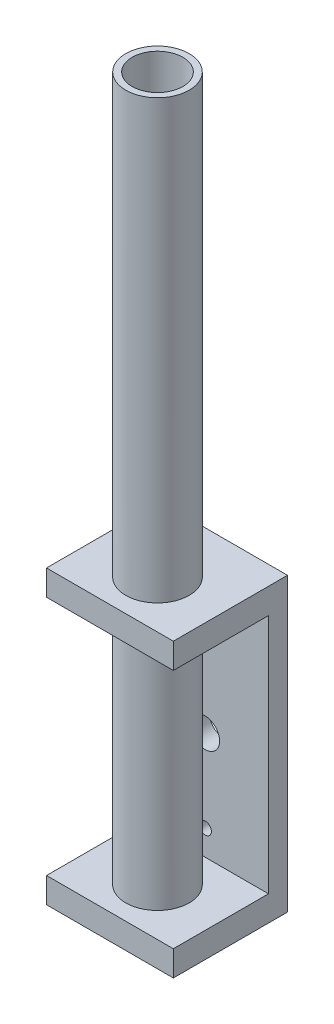
ISO-10303-21;
HEADER;
FILE_DESCRIPTION(('STEP AP214'),'2;1');
FILE_NAME('part.step','',(''),(''),'','','');
FILE_SCHEMA(('AUTOMOTIVE_DESIGN { 1 0 10303 214 1 1 1 1 }'));
ENDSEC;
DATA;
#1=APPLICATION_CONTEXT('core data for automotive mechanical design processes');
#2=APPLICATION_PROTOCOL_DEFINITION('international standard','automotive_design',2000,#1);
#3=PRODUCT_CONTEXT('',#1,'mechanical');
#4=PRODUCT('Part','Part','',(#3));
#5=PRODUCT_RELATED_PRODUCT_CATEGORY('part','',(#4));
#6=PRODUCT_DEFINITION_FORMATION('','',#4);
#7=PRODUCT_DEFINITION_CONTEXT('part definition',#1,'design');
#8=PRODUCT_DEFINITION('design','',#6,#7);
#9=PRODUCT_DEFINITION_SHAPE('','',#8);
#10=(LENGTH_UNIT() NAMED_UNIT(*) SI_UNIT(.MILLI.,.METRE.));
#11=(NAMED_UNIT(*) PLANE_ANGLE_UNIT() SI_UNIT($,.RADIAN.));
#12=(NAMED_UNIT(*) SI_UNIT($,.STERADIAN.) SOLID_ANGLE_UNIT());
#13=UNCERTAINTY_MEASURE_WITH_UNIT(LENGTH_MEASURE(1.E-05),#10,'distance_accuracy_value','');
#14=(GEOMETRIC_REPRESENTATION_CONTEXT(3) GLOBAL_UNCERTAINTY_ASSIGNED_CONTEXT((#13)) GLOBAL_UNIT_ASSIGNED_CONTEXT((#10,
#11,#12)) REPRESENTATION_CONTEXT('',''));
#15=CARTESIAN_POINT('',(0.,0.,0.));
#16=DIRECTION('',(0.,0.,1.));
#17=DIRECTION('',(1.,0.,0.));
#18=AXIS2_PLACEMENT_3D('',#15,#16,#17);
#19=CARTESIAN_POINT('',(11.641947402844,-18.,10.5));
#20=DIRECTION('',(0.,-1.,0.));
#21=DIRECTION('',(1.,0.,0.));
#22=AXIS2_PLACEMENT_3D('',#19,#20,#21);
#23=CYLINDRICAL_SURFACE('',#22,3.25);
#24=CARTESIAN_POINT('',(11.641947402844,-18.,10.5));
#25=DIRECTION('',(0.,-1.,0.));
#26=DIRECTION('',(1.,0.,0.));
#27=AXIS2_PLACEMENT_3D('',#24,#25,#26);
#28=CIRCLE('',#27,3.25);
#29=CARTESIAN_POINT('',(14.891947402844,-18.,10.5));
#30=VERTEX_POINT('',#29);
#31=EDGE_CURVE('E157',#30,#30,#28,.T.);
#32=ORIENTED_EDGE('',*,*,#31,.F.);
#33=EDGE_LOOP('',(#32));
#34=FACE_BOUND('',#33,.T.);
#35=CARTESIAN_POINT('',(11.641947402844,-19.,10.5));
#36=DIRECTION('',(0.,-1.,0.));
#37=DIRECTION('',(1.,0.,0.));
#38=AXIS2_PLACEMENT_3D('',#35,#36,#37);
#39=CIRCLE('',#38,3.25);
#40=CARTESIAN_POINT('',(14.891947402844,-19.,10.5));
#41=VERTEX_POINT('',#40);
#42=EDGE_CURVE('E12',#41,#41,#39,.F.);
#43=ORIENTED_EDGE('',*,*,#42,.F.);
#44=EDGE_LOOP('',(#43));
#45=FACE_BOUND('',#44,.T.);
#46=ADVANCED_FACE('F56',(#34,#45),#23,.F.);
#47=CARTESIAN_POINT('',(11.641947402844,-17.,10.5));
#48=DIRECTION('',(0.,-1.,0.));
#49=DIRECTION('',(1.,0.,0.));
#50=AXIS2_PLACEMENT_3D('',#47,#48,#49);
#51=CYLINDRICAL_SURFACE('',#50,4.);
#52=CARTESIAN_POINT('',(11.641947402844,94.,10.5));
#53=DIRECTION('',(0.,-1.,0.));
#54=DIRECTION('',(1.,0.,0.));
#55=AXIS2_PLACEMENT_3D('',#52,#53,#54);
#56=CIRCLE('',#55,4.);
#57=CARTESIAN_POINT('',(15.641947402844,94.,10.5));
#58=VERTEX_POINT('',#57);
#59=EDGE_CURVE('E160',#58,#58,#56,.F.);
#60=ORIENTED_EDGE('',*,*,#59,.T.);
#61=EDGE_LOOP('',(#60));
#62=FACE_BOUND('',#61,.T.);
#63=CARTESIAN_POINT('',(11.641947402844,-18.,10.5));
#64=DIRECTION('',(0.,-1.,0.));
#65=DIRECTION('',(1.,0.,0.));
#66=AXIS2_PLACEMENT_3D('',#63,#64,#65);
#67=CIRCLE('',#66,4.);
#68=CARTESIAN_POINT('',(15.641947402844,-18.,10.5));
#69=VERTEX_POINT('',#68);
#70=EDGE_CURVE('E65',#69,#69,#67,.F.);
#71=ORIENTED_EDGE('',*,*,#70,.F.);
#72=EDGE_LOOP('',(#71));
#73=FACE_BOUND('',#72,.T.);
#74=ADVANCED_FACE('F267',(#62,#73),#51,.F.);
#75=CARTESIAN_POINT('',(0.,0.,3.));
#76=DIRECTION('',(0.,0.,1.));
#77=DIRECTION('',(1.,0.,0.));
#78=AXIS2_PLACEMENT_3D('',#75,#76,#77);
#79=PLANE('',#78);
#80=CARTESIAN_POINT('',(11.6842084772657,-13.,3.));
#81=DIRECTION('',(0.,0.,1.));
#82=DIRECTION('',(1.,0.,0.));
#83=AXIS2_PLACEMENT_3D('',#80,#81,#82);
#84=CIRCLE('',#83,0.954999999999999);
#85=CARTESIAN_POINT('',(12.6392084772657,-13.,3.));
#86=VERTEX_POINT('',#85);
#87=EDGE_CURVE('E204',#86,#86,#84,.T.);
#88=ORIENTED_EDGE('',*,*,#87,.F.);
#89=EDGE_LOOP('',(#88));
#90=FACE_BOUND('',#89,.T.);
#91=CARTESIAN_POINT('',(11.5996863284223,13.,3.));
#92=DIRECTION('',(0.,0.,1.));
#93=DIRECTION('',(1.,0.,0.));
#94=AXIS2_PLACEMENT_3D('',#91,#92,#93);
#95=CIRCLE('',#94,0.954999999999999);
#96=CARTESIAN_POINT('',(12.5546863284223,13.,3.));
#97=VERTEX_POINT('',#96);
#98=EDGE_CURVE('E212',#97,#97,#95,.T.);
#99=ORIENTED_EDGE('',*,*,#98,.F.);
#100=EDGE_LOOP('',(#99));
#101=FACE_BOUND('',#100,.T.);
#102=CARTESIAN_POINT('',(11.641947402844,0.,3.));
#103=DIRECTION('',(0.,0.,1.));
#104=DIRECTION('',(1.,0.,0.));
#105=AXIS2_PLACEMENT_3D('',#102,#103,#104);
#106=CIRCLE('',#105,2.3);
#107=CARTESIAN_POINT('',(13.941947402844,0.,3.));
#108=VERTEX_POINT('',#107);
#109=EDGE_CURVE('E196',#108,#108,#106,.T.);
#110=ORIENTED_EDGE('',*,*,#109,.F.);
#111=EDGE_LOOP('',(#110));
#112=FACE_BOUND('',#111,.T.);
#113=DIRECTION('',(0.,1.,0.));
#114=VECTOR('',#113,1.);
#115=CARTESIAN_POINT('',(21.6419474028441,-21.,3.));
#116=LINE('',#115,#114);
#117=CARTESIAN_POINT('',(21.6419474028441,-17.,3.));
#118=VERTEX_POINT('',#117);
#119=CARTESIAN_POINT('',(21.6419474028441,21.,3.));
#120=VERTEX_POINT('',#119);
#121=EDGE_CURVE('E77',#118,#120,#116,.T.);
#122=ORIENTED_EDGE('',*,*,#121,.T.);
#123=DIRECTION('',(1.,0.,0.));
#124=VECTOR('',#123,1.);
#125=CARTESIAN_POINT('',(1.64194740284404,21.,3.));
#126=LINE('',#125,#124);
#127=CARTESIAN_POINT('',(1.64194740284406,21.,3.));
#128=VERTEX_POINT('',#127);
#129=EDGE_CURVE('E72',#128,#120,#126,.T.);
#130=ORIENTED_EDGE('',*,*,#129,.F.);
#131=DIRECTION('',(0.,-1.,0.));
#132=VECTOR('',#131,1.);
#133=CARTESIAN_POINT('',(1.64194740284406,-21.,3.));
#134=LINE('',#133,#132);
#135=CARTESIAN_POINT('',(1.64194740284403,-17.,3.));
#136=VERTEX_POINT('',#135);
#137=EDGE_CURVE('E220',#128,#136,#134,.T.);
#138=ORIENTED_EDGE('',*,*,#137,.T.);
#139=DIRECTION('',(1.,0.,0.));
#140=VECTOR('',#139,1.);
#141=CARTESIAN_POINT('',(1.64194740284403,-17.,3.));
#142=LINE('',#141,#140);
#143=EDGE_CURVE('E173',#136,#118,#142,.T.);
#144=ORIENTED_EDGE('',*,*,#143,.T.);
#145=EDGE_LOOP('',(#122,#130,#138,#144));
#146=FACE_BOUND('',#145,.T.);
#147=ADVANCED_FACE('F269',(#90,#101,#112,#146),#79,.T.);
#148=CARTESIAN_POINT('',(11.641947402844,94.,10.5));
#149=DIRECTION('',(0.,-1.,0.));
#150=DIRECTION('',(1.,0.,0.));
#151=AXIS2_PLACEMENT_3D('',#148,#149,#150);
#152=CYLINDRICAL_SURFACE('',#151,5.);
#153=CARTESIAN_POINT('',(11.641947402844,-17.,10.5));
#154=DIRECTION('',(0.,1.,0.));
#155=DIRECTION('',(-1.,0.,0.));
#156=AXIS2_PLACEMENT_3D('',#153,#154,#155);
#157=CIRCLE('',#156,5.);
#158=CARTESIAN_POINT('',(6.64194740284402,-17.,10.5));
#159=VERTEX_POINT('',#158);
#160=EDGE_CURVE('E251',#159,#159,#157,.T.);
#161=ORIENTED_EDGE('',*,*,#160,.T.);
#162=EDGE_LOOP('',(#161));
#163=FACE_BOUND('',#162,.T.);
#164=CARTESIAN_POINT('',(11.641947402844,21.,10.5));
#165=DIRECTION('',(0.,1.,0.));
#166=DIRECTION('',(0.,0.,1.));
#167=AXIS2_PLACEMENT_3D('',#164,#165,#166);
#168=CIRCLE('',#167,5.);
#169=CARTESIAN_POINT('',(11.641947402844,21.,15.5));
#170=VERTEX_POINT('',#169);
#171=EDGE_CURVE('E141',#170,#170,#168,.F.);
#172=ORIENTED_EDGE('',*,*,#171,.T.);
#173=EDGE_LOOP('',(#172));
#174=FACE_BOUND('',#173,.T.);
#175=ADVANCED_FACE('F276',(#163,#174),#152,.T.);
#176=CARTESIAN_POINT('',(0.,0.,0.));
#177=DIRECTION('',(0.,0.,1.));
#178=DIRECTION('',(1.,0.,0.));
#179=AXIS2_PLACEMENT_3D('',#176,#177,#178);
#180=PLANE('',#179);
#181=DIRECTION('',(0.,-1.,0.));
#182=VECTOR('',#181,1.);
#183=CARTESIAN_POINT('',(1.64194740284406,-21.,0.));
#184=LINE('',#183,#182);
#185=CARTESIAN_POINT('',(1.64194740284406,25.,0.));
#186=VERTEX_POINT('',#185);
#187=CARTESIAN_POINT('',(1.64194740284406,-21.,0.));
#188=VERTEX_POINT('',#187);
#189=EDGE_CURVE('E216',#186,#188,#184,.T.);
#190=ORIENTED_EDGE('',*,*,#189,.F.);
#191=DIRECTION('',(-1.,0.,0.));
#192=VECTOR('',#191,1.);
#193=CARTESIAN_POINT('',(21.6419474028441,25.,0.));
#194=LINE('',#193,#192);
#195=CARTESIAN_POINT('',(21.6419474028441,25.,0.));
#196=VERTEX_POINT('',#195);
#197=EDGE_CURVE('E223',#196,#186,#194,.T.);
#198=ORIENTED_EDGE('',*,*,#197,.F.);
#199=DIRECTION('',(0.,1.,0.));
#200=VECTOR('',#199,1.);
#201=CARTESIAN_POINT('',(21.6419474028441,-21.,0.));
#202=LINE('',#201,#200);
#203=CARTESIAN_POINT('',(21.6419474028441,-21.,0.));
#204=VERTEX_POINT('',#203);
#205=EDGE_CURVE('E233',#204,#196,#202,.T.);
#206=ORIENTED_EDGE('',*,*,#205,.F.);
#207=DIRECTION('',(1.,0.,0.));
#208=VECTOR('',#207,1.);
#209=CARTESIAN_POINT('',(21.6419474028441,-21.,0.));
#210=LINE('',#209,#208);
#211=EDGE_CURVE('E230',#188,#204,#210,.T.);
#212=ORIENTED_EDGE('',*,*,#211,.F.);
#213=EDGE_LOOP('',(#190,#198,#206,#212));
#214=FACE_BOUND('',#213,.T.);
#215=CARTESIAN_POINT('',(11.5996863284223,13.,0.));
#216=DIRECTION('',(0.,0.,1.));
#217=DIRECTION('',(1.,0.,0.));
#218=AXIS2_PLACEMENT_3D('',#215,#216,#217);
#219=CIRCLE('',#218,0.954999999999999);
#220=CARTESIAN_POINT('',(12.5546863284223,13.,0.));
#221=VERTEX_POINT('',#220);
#222=EDGE_CURVE('E208',#221,#221,#219,.T.);
#223=ORIENTED_EDGE('',*,*,#222,.T.);
#224=EDGE_LOOP('',(#223));
#225=FACE_BOUND('',#224,.T.);
#226=CARTESIAN_POINT('',(11.6842084772657,-13.,0.));
#227=DIRECTION('',(0.,0.,1.));
#228=DIRECTION('',(1.,0.,0.));
#229=AXIS2_PLACEMENT_3D('',#226,#227,#228);
#230=CIRCLE('',#229,0.954999999999999);
#231=CARTESIAN_POINT('',(12.6392084772657,-13.,0.));
#232=VERTEX_POINT('',#231);
#233=EDGE_CURVE('E200',#232,#232,#230,.T.);
#234=ORIENTED_EDGE('',*,*,#233,.T.);
#235=EDGE_LOOP('',(#234));
#236=FACE_BOUND('',#235,.T.);
#237=CARTESIAN_POINT('',(11.641947402844,0.,0.));
#238=DIRECTION('',(0.,0.,1.));
#239=DIRECTION('',(1.,0.,0.));
#240=AXIS2_PLACEMENT_3D('',#237,#238,#239);
#241=CIRCLE('',#240,2.3);
#242=CARTESIAN_POINT('',(13.941947402844,0.,0.));
#243=VERTEX_POINT('',#242);
#244=EDGE_CURVE('E192',#243,#243,#241,.T.);
#245=ORIENTED_EDGE('',*,*,#244,.T.);
#246=EDGE_LOOP('',(#245));
#247=FACE_BOUND('',#246,.T.);
#248=ADVANCED_FACE('F306',(#214,#225,#236,#247),#180,.F.);
#249=CARTESIAN_POINT('',(1.64194740284406,-21.,3.));
#250=DIRECTION('',(1.,0.,0.));
#251=DIRECTION('',(0.,0.,-1.));
#252=AXIS2_PLACEMENT_3D('',#249,#250,#251);
#253=PLANE('',#252);
#254=ORIENTED_EDGE('',*,*,#189,.T.);
#255=DIRECTION('',(0.,0.,-1.));
#256=VECTOR('',#255,1.);
#257=CARTESIAN_POINT('',(1.64194740284406,-21.,3.));
#258=LINE('',#257,#256);
#259=CARTESIAN_POINT('',(1.64194740284402,-21.,18.));
#260=VERTEX_POINT('',#259);
#261=EDGE_CURVE('E247',#260,#188,#258,.T.);
#262=ORIENTED_EDGE('',*,*,#261,.F.);
#263=DIRECTION('',(0.,-1.,0.));
#264=VECTOR('',#263,1.);
#265=CARTESIAN_POINT('',(1.64194740284402,-17.,18.));
#266=LINE('',#265,#264);
#267=CARTESIAN_POINT('',(1.64194740284402,-17.,18.));
#268=VERTEX_POINT('',#267);
#269=EDGE_CURVE('E188',#268,#260,#266,.T.);
#270=ORIENTED_EDGE('',*,*,#269,.F.);
#271=DIRECTION('',(0.,0.,-1.));
#272=VECTOR('',#271,1.);
#273=CARTESIAN_POINT('',(1.64194740284403,-17.,3.));
#274=LINE('',#273,#272);
#275=EDGE_CURVE('E169',#268,#136,#274,.T.);
#276=ORIENTED_EDGE('',*,*,#275,.T.);
#277=ORIENTED_EDGE('',*,*,#137,.F.);
#278=DIRECTION('',(0.,0.,1.));
#279=VECTOR('',#278,1.);
#280=CARTESIAN_POINT('',(1.64194740284404,21.,3.));
#281=LINE('',#280,#279);
#282=CARTESIAN_POINT('',(1.64194740284404,21.,18.));
#283=VERTEX_POINT('',#282);
#284=EDGE_CURVE('E147',#128,#283,#281,.T.);
#285=ORIENTED_EDGE('',*,*,#284,.T.);
#286=DIRECTION('',(0.,1.,0.));
#287=VECTOR('',#286,1.);
#288=CARTESIAN_POINT('',(1.64194740284404,21.,18.));
#289=LINE('',#288,#287);
#290=CARTESIAN_POINT('',(1.64194740284404,25.,18.));
#291=VERTEX_POINT('',#290);
#292=EDGE_CURVE('E142',#283,#291,#289,.T.);
#293=ORIENTED_EDGE('',*,*,#292,.T.);
#294=DIRECTION('',(0.,0.,-1.));
#295=VECTOR('',#294,1.);
#296=CARTESIAN_POINT('',(1.64194740284406,25.,3.));
#297=LINE('',#296,#295);
#298=EDGE_CURVE('E226',#291,#186,#297,.T.);
#299=ORIENTED_EDGE('',*,*,#298,.T.);
#300=EDGE_LOOP('',(#254,#262,#270,#276,#277,#285,#293,#299));
#301=FACE_BOUND('',#300,.T.);
#302=ADVANCED_FACE('F58',(#301),#253,.F.);
#303=CARTESIAN_POINT('',(21.6419474028441,-21.,3.));
#304=DIRECTION('',(0.,1.,0.));
#305=DIRECTION('',(-1.,0.,0.));
#306=AXIS2_PLACEMENT_3D('',#303,#304,#305);
#307=PLANE('',#306);
#308=ORIENTED_EDGE('',*,*,#211,.T.);
#309=DIRECTION('',(0.,0.,-1.));
#310=VECTOR('',#309,1.);
#311=CARTESIAN_POINT('',(21.6419474028441,-21.,3.));
#312=LINE('',#311,#310);
#313=CARTESIAN_POINT('',(21.641947402844,-21.,18.));
#314=VERTEX_POINT('',#313);
#315=EDGE_CURVE('E243',#314,#204,#312,.T.);
#316=ORIENTED_EDGE('',*,*,#315,.F.);
#317=DIRECTION('',(-1.,0.,0.));
#318=VECTOR('',#317,1.);
#319=CARTESIAN_POINT('',(1.64194740284402,-21.,18.));
#320=LINE('',#319,#318);
#321=EDGE_CURVE('E168',#314,#260,#320,.T.);
#322=ORIENTED_EDGE('',*,*,#321,.T.);
#323=ORIENTED_EDGE('',*,*,#261,.T.);
#324=EDGE_LOOP('',(#308,#316,#322,#323));
#325=FACE_BOUND('',#324,.T.);
#326=CARTESIAN_POINT('',(11.641947402844,-21.,10.5));
#327=DIRECTION('',(0.,-1.,0.));
#328=DIRECTION('',(1.,0.,0.));
#329=AXIS2_PLACEMENT_3D('',#326,#327,#328);
#330=CIRCLE('',#329,2.);
#331=CARTESIAN_POINT('',(13.641947402844,-21.,10.5));
#332=VERTEX_POINT('',#331);
#333=EDGE_CURVE('E324',#332,#332,#330,.T.);
#334=ORIENTED_EDGE('',*,*,#333,.F.);
#335=EDGE_LOOP('',(#334));
#336=FACE_BOUND('',#335,.T.);
#337=ADVANCED_FACE('F314',(#325,#336),#307,.F.);
#338=CARTESIAN_POINT('',(21.6419474028441,-21.,3.));
#339=DIRECTION('',(-1.,0.,0.));
#340=DIRECTION('',(0.,0.,1.));
#341=AXIS2_PLACEMENT_3D('',#338,#339,#340);
#342=PLANE('',#341);
#343=ORIENTED_EDGE('',*,*,#205,.T.);
#344=DIRECTION('',(0.,0.,-1.));
#345=VECTOR('',#344,1.);
#346=CARTESIAN_POINT('',(21.6419474028441,25.,3.));
#347=LINE('',#346,#345);
#348=CARTESIAN_POINT('',(21.641947402844,25.,18.));
#349=VERTEX_POINT('',#348);
#350=EDGE_CURVE('E136',#349,#196,#347,.T.);
#351=ORIENTED_EDGE('',*,*,#350,.F.);
#352=DIRECTION('',(0.,1.,0.));
#353=VECTOR('',#352,1.);
#354=CARTESIAN_POINT('',(21.641947402844,21.,18.));
#355=LINE('',#354,#353);
#356=CARTESIAN_POINT('',(21.641947402844,21.,18.));
#357=VERTEX_POINT('',#356);
#358=EDGE_CURVE('E133',#357,#349,#355,.T.);
#359=ORIENTED_EDGE('',*,*,#358,.F.);
#360=DIRECTION('',(0.,0.,1.));
#361=VECTOR('',#360,1.);
#362=CARTESIAN_POINT('',(21.641947402844,21.,3.));
#363=LINE('',#362,#361);
#364=EDGE_CURVE('E121',#120,#357,#363,.T.);
#365=ORIENTED_EDGE('',*,*,#364,.F.);
#366=ORIENTED_EDGE('',*,*,#121,.F.);
#367=DIRECTION('',(0.,0.,1.));
#368=VECTOR('',#367,1.);
#369=CARTESIAN_POINT('',(21.641947402844,-17.,3.));
#370=LINE('',#369,#368);
#371=CARTESIAN_POINT('',(21.641947402844,-17.,18.));
#372=VERTEX_POINT('',#371);
#373=EDGE_CURVE('E176',#118,#372,#370,.T.);
#374=ORIENTED_EDGE('',*,*,#373,.T.);
#375=DIRECTION('',(0.,-1.,0.));
#376=VECTOR('',#375,1.);
#377=CARTESIAN_POINT('',(21.641947402844,-17.,18.));
#378=LINE('',#377,#376);
#379=EDGE_CURVE('E184',#372,#314,#378,.T.);
#380=ORIENTED_EDGE('',*,*,#379,.T.);
#381=ORIENTED_EDGE('',*,*,#315,.T.);
#382=EDGE_LOOP('',(#343,#351,#359,#365,#366,#374,#380,#381));
#383=FACE_BOUND('',#382,.T.);
#384=ADVANCED_FACE('F134',(#383),#342,.F.);
#385=CARTESIAN_POINT('',(21.6419474028441,25.,3.));
#386=DIRECTION('',(0.,-1.,0.));
#387=DIRECTION('',(1.,0.,0.));
#388=AXIS2_PLACEMENT_3D('',#385,#386,#387);
#389=PLANE('',#388);
#390=ORIENTED_EDGE('',*,*,#197,.T.);
#391=ORIENTED_EDGE('',*,*,#298,.F.);
#392=DIRECTION('',(1.,0.,0.));
#393=VECTOR('',#392,1.);
#394=CARTESIAN_POINT('',(1.64194740284404,25.,18.));
#395=LINE('',#394,#393);
#396=EDGE_CURVE('E130',#291,#349,#395,.T.);
#397=ORIENTED_EDGE('',*,*,#396,.T.);
#398=ORIENTED_EDGE('',*,*,#350,.T.);
#399=EDGE_LOOP('',(#390,#391,#397,#398));
#400=FACE_BOUND('',#399,.T.);
#401=CARTESIAN_POINT('',(11.641947402844,25.,10.5));
#402=DIRECTION('',(0.,1.,0.));
#403=DIRECTION('',(0.,0.,1.));
#404=AXIS2_PLACEMENT_3D('',#401,#402,#403);
#405=CIRCLE('',#404,5.);
#406=CARTESIAN_POINT('',(11.641947402844,25.,15.5));
#407=VERTEX_POINT('',#406);
#408=EDGE_CURVE('E255',#407,#407,#405,.F.);
#409=ORIENTED_EDGE('',*,*,#408,.T.);
#410=EDGE_LOOP('',(#409));
#411=FACE_BOUND('',#410,.T.);
#412=ADVANCED_FACE('F303',(#400,#411),#389,.F.);
#413=CARTESIAN_POINT('',(11.5996863284223,13.,3.));
#414=DIRECTION('',(0.,0.,-1.));
#415=DIRECTION('',(-1.,0.,0.));
#416=AXIS2_PLACEMENT_3D('',#413,#414,#415);
#417=CYLINDRICAL_SURFACE('',#416,0.954999999999999);
#418=ORIENTED_EDGE('',*,*,#98,.T.);
#419=EDGE_LOOP('',(#418));
#420=FACE_BOUND('',#419,.T.);
#421=ORIENTED_EDGE('',*,*,#222,.F.);
#422=EDGE_LOOP('',(#421));
#423=FACE_BOUND('',#422,.T.);
#424=ADVANCED_FACE('F300',(#420,#423),#417,.F.);
#425=CARTESIAN_POINT('',(11.6842084772657,-13.,3.));
#426=DIRECTION('',(0.,0.,-1.));
#427=DIRECTION('',(-1.,0.,0.));
#428=AXIS2_PLACEMENT_3D('',#425,#426,#427);
#429=CYLINDRICAL_SURFACE('',#428,0.954999999999999);
#430=ORIENTED_EDGE('',*,*,#87,.T.);
#431=EDGE_LOOP('',(#430));
#432=FACE_BOUND('',#431,.T.);
#433=ORIENTED_EDGE('',*,*,#233,.F.);
#434=EDGE_LOOP('',(#433));
#435=FACE_BOUND('',#434,.T.);
#436=ADVANCED_FACE('F296',(#432,#435),#429,.F.);
#437=CARTESIAN_POINT('',(11.641947402844,0.,3.));
#438=DIRECTION('',(0.,0.,-1.));
#439=DIRECTION('',(-1.,0.,0.));
#440=AXIS2_PLACEMENT_3D('',#437,#438,#439);
#441=CYLINDRICAL_SURFACE('',#440,2.3);
#442=ORIENTED_EDGE('',*,*,#109,.T.);
#443=EDGE_LOOP('',(#442));
#444=FACE_BOUND('',#443,.T.);
#445=ORIENTED_EDGE('',*,*,#244,.F.);
#446=EDGE_LOOP('',(#445));
#447=FACE_BOUND('',#446,.T.);
#448=ADVANCED_FACE('F292',(#444,#447),#441,.F.);
#449=CARTESIAN_POINT('',(1.64194740284402,-17.,18.));
#450=DIRECTION('',(0.,0.,1.));
#451=DIRECTION('',(1.,0.,0.));
#452=AXIS2_PLACEMENT_3D('',#449,#450,#451);
#453=PLANE('',#452);
#454=ORIENTED_EDGE('',*,*,#321,.F.);
#455=ORIENTED_EDGE('',*,*,#379,.F.);
#456=DIRECTION('',(-1.,0.,0.));
#457=VECTOR('',#456,1.);
#458=CARTESIAN_POINT('',(1.64194740284402,-17.,18.));
#459=LINE('',#458,#457);
#460=EDGE_CURVE('E180',#372,#268,#459,.T.);
#461=ORIENTED_EDGE('',*,*,#460,.T.);
#462=ORIENTED_EDGE('',*,*,#269,.T.);
#463=EDGE_LOOP('',(#454,#455,#461,#462));
#464=FACE_BOUND('',#463,.T.);
#465=ADVANCED_FACE('F288',(#464),#453,.T.);
#466=CARTESIAN_POINT('',(0.,-17.,0.));
#467=DIRECTION('',(0.,1.,0.));
#468=DIRECTION('',(-1.,0.,0.));
#469=AXIS2_PLACEMENT_3D('',#466,#467,#468);
#470=PLANE('',#469);
#471=ORIENTED_EDGE('',*,*,#160,.F.);
#472=EDGE_LOOP('',(#471));
#473=FACE_BOUND('',#472,.T.);
#474=ORIENTED_EDGE('',*,*,#275,.F.);
#475=ORIENTED_EDGE('',*,*,#460,.F.);
#476=ORIENTED_EDGE('',*,*,#373,.F.);
#477=ORIENTED_EDGE('',*,*,#143,.F.);
#478=EDGE_LOOP('',(#474,#475,#476,#477));
#479=FACE_BOUND('',#478,.T.);
#480=ADVANCED_FACE('F285',(#473,#479),#470,.T.);
#481=ORIENTED_EDGE('',*,*,#408,.F.);
#482=EDGE_LOOP('',(#481));
#483=FACE_BOUND('',#482,.T.);
#484=CARTESIAN_POINT('',(11.641947402844,94.,10.5));
#485=DIRECTION('',(0.,-1.,0.));
#486=DIRECTION('',(1.,0.,0.));
#487=AXIS2_PLACEMENT_3D('',#484,#485,#486);
#488=CIRCLE('',#487,5.);
#489=CARTESIAN_POINT('',(16.641947402844,94.,10.5));
#490=VERTEX_POINT('',#489);
#491=EDGE_CURVE('E164',#490,#490,#488,.T.);
#492=ORIENTED_EDGE('',*,*,#491,.T.);
#493=EDGE_LOOP('',(#492));
#494=FACE_BOUND('',#493,.T.);
#495=ADVANCED_FACE('F283',(#483,#494),#152,.T.);
#496=CARTESIAN_POINT('',(0.,94.,0.));
#497=DIRECTION('',(0.,-1.,0.));
#498=DIRECTION('',(1.,0.,0.));
#499=AXIS2_PLACEMENT_3D('',#496,#497,#498);
#500=PLANE('',#499);
#501=ORIENTED_EDGE('',*,*,#59,.F.);
#502=EDGE_LOOP('',(#501));
#503=FACE_BOUND('',#502,.T.);
#504=ORIENTED_EDGE('',*,*,#491,.F.);
#505=EDGE_LOOP('',(#504));
#506=FACE_BOUND('',#505,.T.);
#507=ADVANCED_FACE('F356',(#503,#506),#500,.F.);
#508=CARTESIAN_POINT('',(1.64194740284404,21.,18.));
#509=DIRECTION('',(0.,0.,1.));
#510=DIRECTION('',(1.,0.,0.));
#511=AXIS2_PLACEMENT_3D('',#508,#509,#510);
#512=PLANE('',#511);
#513=ORIENTED_EDGE('',*,*,#396,.F.);
#514=ORIENTED_EDGE('',*,*,#292,.F.);
#515=DIRECTION('',(1.,0.,0.));
#516=VECTOR('',#515,1.);
#517=CARTESIAN_POINT('',(1.64194740284404,21.,18.));
#518=LINE('',#517,#516);
#519=EDGE_CURVE('E126',#283,#357,#518,.T.);
#520=ORIENTED_EDGE('',*,*,#519,.T.);
#521=ORIENTED_EDGE('',*,*,#358,.T.);
#522=EDGE_LOOP('',(#513,#514,#520,#521));
#523=FACE_BOUND('',#522,.T.);
#524=ADVANCED_FACE('F144',(#523),#512,.T.);
#525=CARTESIAN_POINT('',(0.,21.,0.));
#526=DIRECTION('',(0.,1.,0.));
#527=DIRECTION('',(0.,0.,1.));
#528=AXIS2_PLACEMENT_3D('',#525,#526,#527);
#529=PLANE('',#528);
#530=ORIENTED_EDGE('',*,*,#171,.F.);
#531=EDGE_LOOP('',(#530));
#532=FACE_BOUND('',#531,.T.);
#533=ORIENTED_EDGE('',*,*,#364,.T.);
#534=ORIENTED_EDGE('',*,*,#519,.F.);
#535=ORIENTED_EDGE('',*,*,#284,.F.);
#536=ORIENTED_EDGE('',*,*,#129,.T.);
#537=EDGE_LOOP('',(#533,#534,#535,#536));
#538=FACE_BOUND('',#537,.T.);
#539=ADVANCED_FACE('F123',(#532,#538),#529,.F.);
#540=CARTESIAN_POINT('',(0.,-18.,0.));
#541=DIRECTION('',(0.,-1.,0.));
#542=DIRECTION('',(1.,0.,0.));
#543=AXIS2_PLACEMENT_3D('',#540,#541,#542);
#544=PLANE('',#543);
#545=ORIENTED_EDGE('',*,*,#31,.T.);
#546=EDGE_LOOP('',(#545));
#547=FACE_BOUND('',#546,.T.);
#548=ORIENTED_EDGE('',*,*,#70,.T.);
#549=EDGE_LOOP('',(#548));
#550=FACE_BOUND('',#549,.T.);
#551=ADVANCED_FACE('F265',(#547,#550),#544,.F.);
#552=CARTESIAN_POINT('',(11.641947402844,-19.,10.5));
#553=DIRECTION('',(0.,-1.,0.));
#554=DIRECTION('',(1.,0.,0.));
#555=AXIS2_PLACEMENT_3D('',#552,#553,#554);
#556=CYLINDRICAL_SURFACE('',#555,2.);
#557=CARTESIAN_POINT('',(11.641947402844,-19.,10.5));
#558=DIRECTION('',(0.,-1.,0.));
#559=DIRECTION('',(1.,0.,0.));
#560=AXIS2_PLACEMENT_3D('',#557,#558,#559);
#561=CIRCLE('',#560,2.);
#562=CARTESIAN_POINT('',(13.641947402844,-19.,10.5));
#563=VERTEX_POINT('',#562);
#564=EDGE_CURVE('E327',#563,#563,#561,.T.);
#565=ORIENTED_EDGE('',*,*,#564,.F.);
#566=EDGE_LOOP('',(#565));
#567=FACE_BOUND('',#566,.T.);
#568=ORIENTED_EDGE('',*,*,#333,.T.);
#569=EDGE_LOOP('',(#568));
#570=FACE_BOUND('',#569,.T.);
#571=ADVANCED_FACE('F341',(#567,#570),#556,.F.);
#572=CARTESIAN_POINT('',(0.,-19.,0.));
#573=DIRECTION('',(0.,-1.,0.));
#574=DIRECTION('',(1.,0.,0.));
#575=AXIS2_PLACEMENT_3D('',#572,#573,#574);
#576=PLANE('',#575);
#577=ORIENTED_EDGE('',*,*,#564,.T.);
#578=EDGE_LOOP('',(#577));
#579=FACE_BOUND('',#578,.T.);
#580=ORIENTED_EDGE('',*,*,#42,.T.);
#581=EDGE_LOOP('',(#580));
#582=FACE_BOUND('',#581,.T.);
#583=ADVANCED_FACE('F339',(#579,#582),#576,.F.);
#584=CLOSED_SHELL('',(#46,#74,#147,#175,#248,#302,#337,#384,#412,#424,#436,#448,#465,#480,#495,
#507,#524,#539,#551,#571,#583));
#585=MANIFOLD_SOLID_BREP('B2',#584);
#586=ADVANCED_BREP_SHAPE_REPRESENTATION('',(#18,#585),#14);
#587=SHAPE_DEFINITION_REPRESENTATION(#9,#586);
ENDSEC;
END-ISO-10303-21;
